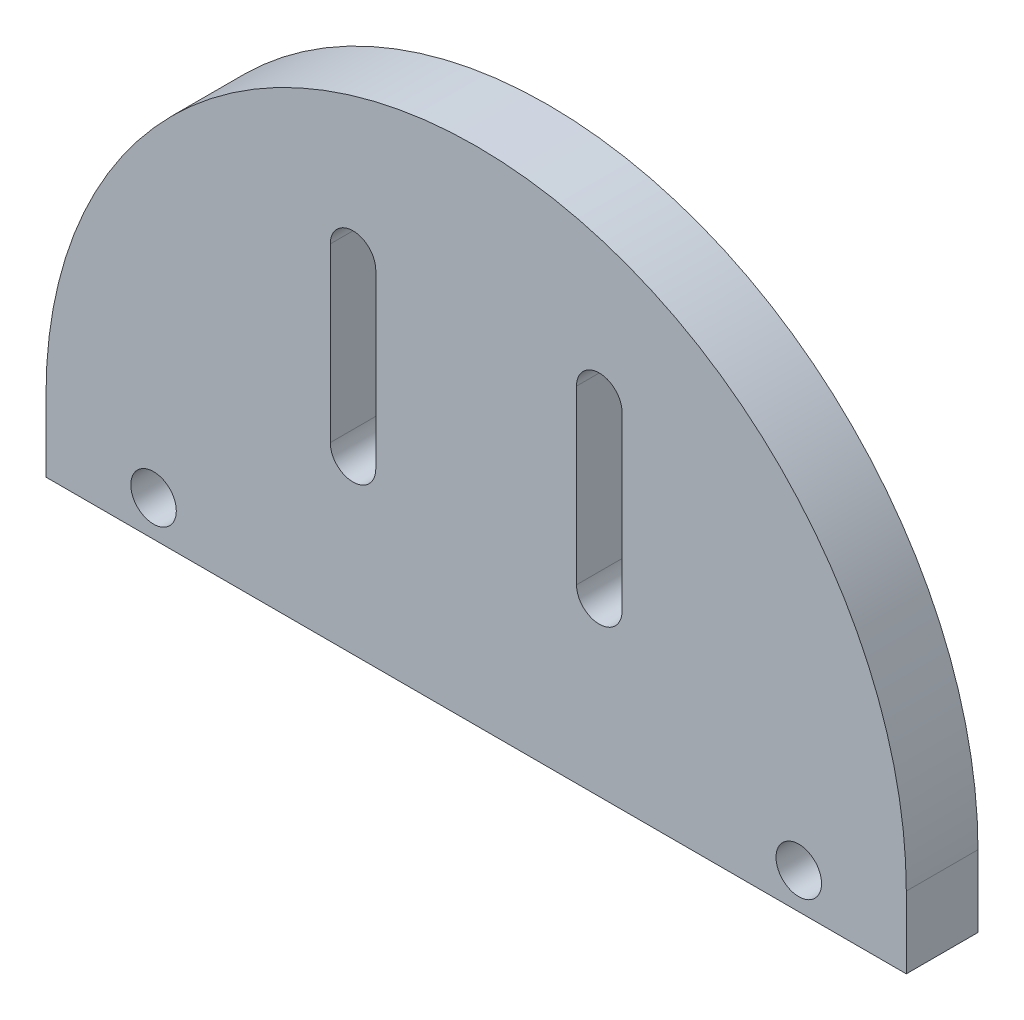
ISO-10303-21;
HEADER;
FILE_DESCRIPTION(('STEP AP214'),'2;1');
FILE_NAME('part.step','',(''),(''),'','','');
FILE_SCHEMA(('AUTOMOTIVE_DESIGN { 1 0 10303 214 1 1 1 1 }'));
ENDSEC;
DATA;
#1=APPLICATION_CONTEXT('core data for automotive mechanical design processes');
#2=APPLICATION_PROTOCOL_DEFINITION('international standard','automotive_design',2000,#1);
#3=PRODUCT_CONTEXT('',#1,'mechanical');
#4=PRODUCT('Part','Part','',(#3));
#5=PRODUCT_RELATED_PRODUCT_CATEGORY('part','',(#4));
#6=PRODUCT_DEFINITION_FORMATION('','',#4);
#7=PRODUCT_DEFINITION_CONTEXT('part definition',#1,'design');
#8=PRODUCT_DEFINITION('design','',#6,#7);
#9=PRODUCT_DEFINITION_SHAPE('','',#8);
#10=(LENGTH_UNIT() NAMED_UNIT(*) SI_UNIT(.MILLI.,.METRE.));
#11=(NAMED_UNIT(*) PLANE_ANGLE_UNIT() SI_UNIT($,.RADIAN.));
#12=(NAMED_UNIT(*) SI_UNIT($,.STERADIAN.) SOLID_ANGLE_UNIT());
#13=UNCERTAINTY_MEASURE_WITH_UNIT(LENGTH_MEASURE(1.E-05),#10,'distance_accuracy_value','');
#14=(GEOMETRIC_REPRESENTATION_CONTEXT(3) GLOBAL_UNCERTAINTY_ASSIGNED_CONTEXT((#13)) GLOBAL_UNIT_ASSIGNED_CONTEXT((#10,
#11,#12)) REPRESENTATION_CONTEXT('',''));
#15=CARTESIAN_POINT('',(0.,0.,0.));
#16=DIRECTION('',(0.,0.,1.));
#17=DIRECTION('',(1.,0.,0.));
#18=AXIS2_PLACEMENT_3D('',#15,#16,#17);
#19=CARTESIAN_POINT('',(0.,0.,5.));
#20=DIRECTION('',(0.,0.,1.));
#21=DIRECTION('',(1.,0.,0.));
#22=AXIS2_PLACEMENT_3D('',#19,#20,#21);
#23=PLANE('',#22);
#24=CARTESIAN_POINT('',(-22.5,-2.5,5.));
#25=DIRECTION('',(0.,0.,1.));
#26=DIRECTION('',(1.,0.,0.));
#27=AXIS2_PLACEMENT_3D('',#24,#25,#26);
#28=CIRCLE('',#27,1.5875);
#29=CARTESIAN_POINT('',(-20.9125,-2.5,5.));
#30=VERTEX_POINT('',#29);
#31=EDGE_CURVE('E151',#30,#30,#28,.T.);
#32=ORIENTED_EDGE('',*,*,#31,.F.);
#33=EDGE_LOOP('',(#32));
#34=FACE_BOUND('',#33,.T.);
#35=DIRECTION('',(0.,-1.,0.));
#36=VECTOR('',#35,1.);
#37=CARTESIAN_POINT('',(7.,7.,5.));
#38=LINE('',#37,#36);
#39=CARTESIAN_POINT('',(7.,19.,5.));
#40=VERTEX_POINT('',#39);
#41=CARTESIAN_POINT('',(7.,7.,5.));
#42=VERTEX_POINT('',#41);
#43=EDGE_CURVE('E163',#40,#42,#38,.T.);
#44=ORIENTED_EDGE('',*,*,#43,.F.);
#45=CARTESIAN_POINT('',(8.5875,19.,5.));
#46=DIRECTION('',(0.,0.,1.));
#47=DIRECTION('',(-1.,0.,0.));
#48=AXIS2_PLACEMENT_3D('',#45,#46,#47);
#49=CIRCLE('',#48,1.5875);
#50=CARTESIAN_POINT('',(10.175,19.,5.));
#51=VERTEX_POINT('',#50);
#52=EDGE_CURVE('E161',#51,#40,#49,.T.);
#53=ORIENTED_EDGE('',*,*,#52,.F.);
#54=DIRECTION('',(0.,1.,0.));
#55=VECTOR('',#54,1.);
#56=CARTESIAN_POINT('',(10.175,7.,5.));
#57=LINE('',#56,#55);
#58=CARTESIAN_POINT('',(10.175,7.,5.));
#59=VERTEX_POINT('',#58);
#60=EDGE_CURVE('E169',#59,#51,#57,.T.);
#61=ORIENTED_EDGE('',*,*,#60,.F.);
#62=CARTESIAN_POINT('',(8.5875,7.,5.));
#63=DIRECTION('',(0.,0.,1.));
#64=DIRECTION('',(-1.,0.,0.));
#65=AXIS2_PLACEMENT_3D('',#62,#63,#64);
#66=CIRCLE('',#65,1.5875);
#67=EDGE_CURVE('E166',#42,#59,#66,.T.);
#68=ORIENTED_EDGE('',*,*,#67,.F.);
#69=EDGE_LOOP('',(#44,#53,#61,#68));
#70=FACE_BOUND('',#69,.T.);
#71=CARTESIAN_POINT('',(0.,0.,5.));
#72=DIRECTION('',(0.,0.,1.));
#73=DIRECTION('',(1.,0.,0.));
#74=AXIS2_PLACEMENT_3D('',#71,#72,#73);
#75=CIRCLE('',#74,30.);
#76=CARTESIAN_POINT('',(30.,0.,5.));
#77=VERTEX_POINT('',#76);
#78=CARTESIAN_POINT('',(-30.,0.,5.));
#79=VERTEX_POINT('',#78);
#80=EDGE_CURVE('E192',#77,#79,#75,.T.);
#81=ORIENTED_EDGE('',*,*,#80,.T.);
#82=DIRECTION('',(0.,-1.,0.));
#83=VECTOR('',#82,1.);
#84=CARTESIAN_POINT('',(-30.,0.,5.));
#85=LINE('',#84,#83);
#86=CARTESIAN_POINT('',(-30.,-5.,5.));
#87=VERTEX_POINT('',#86);
#88=EDGE_CURVE('E195',#79,#87,#85,.T.);
#89=ORIENTED_EDGE('',*,*,#88,.T.);
#90=DIRECTION('',(1.,0.,0.));
#91=VECTOR('',#90,1.);
#92=CARTESIAN_POINT('',(-30.,-5.,5.));
#93=LINE('',#92,#91);
#94=CARTESIAN_POINT('',(30.,-5.,5.));
#95=VERTEX_POINT('',#94);
#96=EDGE_CURVE('E198',#87,#95,#93,.T.);
#97=ORIENTED_EDGE('',*,*,#96,.T.);
#98=DIRECTION('',(0.,1.,0.));
#99=VECTOR('',#98,1.);
#100=CARTESIAN_POINT('',(30.,-5.,5.));
#101=LINE('',#100,#99);
#102=EDGE_CURVE('E200',#95,#77,#101,.T.);
#103=ORIENTED_EDGE('',*,*,#102,.T.);
#104=EDGE_LOOP('',(#81,#89,#97,#103));
#105=FACE_BOUND('',#104,.T.);
#106=DIRECTION('',(0.,1.,0.));
#107=VECTOR('',#106,1.);
#108=CARTESIAN_POINT('',(-7.,7.,5.));
#109=LINE('',#108,#107);
#110=CARTESIAN_POINT('',(-7.,7.,5.));
#111=VERTEX_POINT('',#110);
#112=CARTESIAN_POINT('',(-7.,19.,5.));
#113=VERTEX_POINT('',#112);
#114=EDGE_CURVE('E130',#111,#113,#109,.T.);
#115=ORIENTED_EDGE('',*,*,#114,.F.);
#116=CARTESIAN_POINT('',(-8.5875,7.,5.));
#117=DIRECTION('',(0.,0.,1.));
#118=DIRECTION('',(1.,0.,0.));
#119=AXIS2_PLACEMENT_3D('',#116,#117,#118);
#120=CIRCLE('',#119,1.5875);
#121=CARTESIAN_POINT('',(-10.175,7.,5.));
#122=VERTEX_POINT('',#121);
#123=EDGE_CURVE('E122',#122,#111,#120,.T.);
#124=ORIENTED_EDGE('',*,*,#123,.F.);
#125=DIRECTION('',(0.,-1.,0.));
#126=VECTOR('',#125,1.);
#127=CARTESIAN_POINT('',(-10.175,7.,5.));
#128=LINE('',#127,#126);
#129=CARTESIAN_POINT('',(-10.175,19.,5.));
#130=VERTEX_POINT('',#129);
#131=EDGE_CURVE('E145',#130,#122,#128,.T.);
#132=ORIENTED_EDGE('',*,*,#131,.F.);
#133=CARTESIAN_POINT('',(-8.5875,19.,5.));
#134=DIRECTION('',(0.,0.,1.));
#135=DIRECTION('',(1.,0.,0.));
#136=AXIS2_PLACEMENT_3D('',#133,#134,#135);
#137=CIRCLE('',#136,1.5875);
#138=EDGE_CURVE('E143',#113,#130,#137,.T.);
#139=ORIENTED_EDGE('',*,*,#138,.F.);
#140=EDGE_LOOP('',(#115,#124,#132,#139));
#141=FACE_BOUND('',#140,.T.);
#142=CARTESIAN_POINT('',(22.5,-2.5,5.));
#143=DIRECTION('',(0.,0.,1.));
#144=DIRECTION('',(1.,0.,0.));
#145=AXIS2_PLACEMENT_3D('',#142,#143,#144);
#146=CIRCLE('',#145,1.5875);
#147=CARTESIAN_POINT('',(24.0875,-2.5,5.));
#148=VERTEX_POINT('',#147);
#149=EDGE_CURVE('E310',#148,#148,#146,.T.);
#150=ORIENTED_EDGE('',*,*,#149,.F.);
#151=EDGE_LOOP('',(#150));
#152=FACE_BOUND('',#151,.T.);
#153=ADVANCED_FACE('F33',(#34,#70,#105,#141,#152),#23,.T.);
#154=CARTESIAN_POINT('',(0.,0.,0.));
#155=DIRECTION('',(0.,0.,1.));
#156=DIRECTION('',(1.,0.,0.));
#157=AXIS2_PLACEMENT_3D('',#154,#155,#156);
#158=PLANE('',#157);
#159=CARTESIAN_POINT('',(-22.5,-2.5,0.));
#160=DIRECTION('',(0.,0.,1.));
#161=DIRECTION('',(1.,0.,0.));
#162=AXIS2_PLACEMENT_3D('',#159,#160,#161);
#163=CIRCLE('',#162,1.5875);
#164=CARTESIAN_POINT('',(-20.9125,-2.5,0.));
#165=VERTEX_POINT('',#164);
#166=EDGE_CURVE('E316',#165,#165,#163,.T.);
#167=ORIENTED_EDGE('',*,*,#166,.T.);
#168=EDGE_LOOP('',(#167));
#169=FACE_BOUND('',#168,.T.);
#170=CARTESIAN_POINT('',(8.5875,19.,0.));
#171=DIRECTION('',(0.,0.,1.));
#172=DIRECTION('',(-1.,0.,0.));
#173=AXIS2_PLACEMENT_3D('',#170,#171,#172);
#174=CIRCLE('',#173,1.5875);
#175=CARTESIAN_POINT('',(10.175,19.,0.));
#176=VERTEX_POINT('',#175);
#177=CARTESIAN_POINT('',(7.,19.,0.));
#178=VERTEX_POINT('',#177);
#179=EDGE_CURVE('E138',#176,#178,#174,.T.);
#180=ORIENTED_EDGE('',*,*,#179,.T.);
#181=DIRECTION('',(0.,-1.,0.));
#182=VECTOR('',#181,1.);
#183=CARTESIAN_POINT('',(7.,7.,0.));
#184=LINE('',#183,#182);
#185=CARTESIAN_POINT('',(7.,7.,0.));
#186=VERTEX_POINT('',#185);
#187=EDGE_CURVE('E174',#178,#186,#184,.T.);
#188=ORIENTED_EDGE('',*,*,#187,.T.);
#189=CARTESIAN_POINT('',(8.5875,7.,0.));
#190=DIRECTION('',(0.,0.,1.));
#191=DIRECTION('',(-1.,0.,0.));
#192=AXIS2_PLACEMENT_3D('',#189,#190,#191);
#193=CIRCLE('',#192,1.5875);
#194=CARTESIAN_POINT('',(10.175,7.,0.));
#195=VERTEX_POINT('',#194);
#196=EDGE_CURVE('E177',#186,#195,#193,.T.);
#197=ORIENTED_EDGE('',*,*,#196,.T.);
#198=DIRECTION('',(0.,1.,0.));
#199=VECTOR('',#198,1.);
#200=CARTESIAN_POINT('',(10.175,7.,0.));
#201=LINE('',#200,#199);
#202=EDGE_CURVE('E164',#195,#176,#201,.T.);
#203=ORIENTED_EDGE('',*,*,#202,.T.);
#204=EDGE_LOOP('',(#180,#188,#197,#203));
#205=FACE_BOUND('',#204,.T.);
#206=CARTESIAN_POINT('',(0.,0.,0.));
#207=DIRECTION('',(0.,0.,1.));
#208=DIRECTION('',(1.,0.,0.));
#209=AXIS2_PLACEMENT_3D('',#206,#207,#208);
#210=CIRCLE('',#209,30.);
#211=CARTESIAN_POINT('',(30.,0.,0.));
#212=VERTEX_POINT('',#211);
#213=CARTESIAN_POINT('',(-30.,0.,0.));
#214=VERTEX_POINT('',#213);
#215=EDGE_CURVE('E191',#212,#214,#210,.T.);
#216=ORIENTED_EDGE('',*,*,#215,.F.);
#217=DIRECTION('',(0.,1.,0.));
#218=VECTOR('',#217,1.);
#219=CARTESIAN_POINT('',(30.,-5.,0.));
#220=LINE('',#219,#218);
#221=CARTESIAN_POINT('',(30.,-5.,0.));
#222=VERTEX_POINT('',#221);
#223=EDGE_CURVE('E196',#222,#212,#220,.T.);
#224=ORIENTED_EDGE('',*,*,#223,.F.);
#225=DIRECTION('',(1.,0.,0.));
#226=VECTOR('',#225,1.);
#227=CARTESIAN_POINT('',(-30.,-5.,0.));
#228=LINE('',#227,#226);
#229=CARTESIAN_POINT('',(-30.,-5.,0.));
#230=VERTEX_POINT('',#229);
#231=EDGE_CURVE('E207',#230,#222,#228,.T.);
#232=ORIENTED_EDGE('',*,*,#231,.F.);
#233=DIRECTION('',(0.,-1.,0.));
#234=VECTOR('',#233,1.);
#235=CARTESIAN_POINT('',(-30.,0.,0.));
#236=LINE('',#235,#234);
#237=EDGE_CURVE('E205',#214,#230,#236,.T.);
#238=ORIENTED_EDGE('',*,*,#237,.F.);
#239=EDGE_LOOP('',(#216,#224,#232,#238));
#240=FACE_BOUND('',#239,.T.);
#241=CARTESIAN_POINT('',(-8.5875,7.,0.));
#242=DIRECTION('',(0.,0.,1.));
#243=DIRECTION('',(1.,0.,0.));
#244=AXIS2_PLACEMENT_3D('',#241,#242,#243);
#245=CIRCLE('',#244,1.5875);
#246=CARTESIAN_POINT('',(-10.175,7.,0.));
#247=VERTEX_POINT('',#246);
#248=CARTESIAN_POINT('',(-7.,7.,0.));
#249=VERTEX_POINT('',#248);
#250=EDGE_CURVE('E56',#247,#249,#245,.T.);
#251=ORIENTED_EDGE('',*,*,#250,.T.);
#252=DIRECTION('',(0.,1.,0.));
#253=VECTOR('',#252,1.);
#254=CARTESIAN_POINT('',(-7.,7.,0.));
#255=LINE('',#254,#253);
#256=CARTESIAN_POINT('',(-7.,19.,0.));
#257=VERTEX_POINT('',#256);
#258=EDGE_CURVE('E137',#249,#257,#255,.T.);
#259=ORIENTED_EDGE('',*,*,#258,.T.);
#260=CARTESIAN_POINT('',(-8.5875,19.,0.));
#261=DIRECTION('',(0.,0.,1.));
#262=DIRECTION('',(1.,0.,0.));
#263=AXIS2_PLACEMENT_3D('',#260,#261,#262);
#264=CIRCLE('',#263,1.5875);
#265=CARTESIAN_POINT('',(-10.175,19.,0.));
#266=VERTEX_POINT('',#265);
#267=EDGE_CURVE('E153',#257,#266,#264,.T.);
#268=ORIENTED_EDGE('',*,*,#267,.T.);
#269=DIRECTION('',(0.,-1.,0.));
#270=VECTOR('',#269,1.);
#271=CARTESIAN_POINT('',(-10.175,7.,0.));
#272=LINE('',#271,#270);
#273=EDGE_CURVE('E131',#266,#247,#272,.T.);
#274=ORIENTED_EDGE('',*,*,#273,.T.);
#275=EDGE_LOOP('',(#251,#259,#268,#274));
#276=FACE_BOUND('',#275,.T.);
#277=CARTESIAN_POINT('',(22.5,-2.5,0.));
#278=DIRECTION('',(0.,0.,1.));
#279=DIRECTION('',(1.,0.,0.));
#280=AXIS2_PLACEMENT_3D('',#277,#278,#279);
#281=CIRCLE('',#280,1.5875);
#282=CARTESIAN_POINT('',(24.0875,-2.5,0.));
#283=VERTEX_POINT('',#282);
#284=EDGE_CURVE('E313',#283,#283,#281,.T.);
#285=ORIENTED_EDGE('',*,*,#284,.T.);
#286=EDGE_LOOP('',(#285));
#287=FACE_BOUND('',#286,.T.);
#288=ADVANCED_FACE('F225',(#169,#205,#240,#276,#287),#158,.F.);
#289=CARTESIAN_POINT('',(0.,0.,5.));
#290=DIRECTION('',(0.,0.,-1.));
#291=DIRECTION('',(-1.,0.,0.));
#292=AXIS2_PLACEMENT_3D('',#289,#290,#291);
#293=CYLINDRICAL_SURFACE('',#292,30.);
#294=ORIENTED_EDGE('',*,*,#215,.T.);
#295=DIRECTION('',(0.,0.,-1.));
#296=VECTOR('',#295,1.);
#297=CARTESIAN_POINT('',(-30.,0.,5.));
#298=LINE('',#297,#296);
#299=EDGE_CURVE('E11',#79,#214,#298,.T.);
#300=ORIENTED_EDGE('',*,*,#299,.F.);
#301=ORIENTED_EDGE('',*,*,#80,.F.);
#302=DIRECTION('',(0.,0.,-1.));
#303=VECTOR('',#302,1.);
#304=CARTESIAN_POINT('',(30.,0.,5.));
#305=LINE('',#304,#303);
#306=EDGE_CURVE('E202',#77,#212,#305,.T.);
#307=ORIENTED_EDGE('',*,*,#306,.T.);
#308=EDGE_LOOP('',(#294,#300,#301,#307));
#309=FACE_BOUND('',#308,.T.);
#310=ADVANCED_FACE('F35',(#309),#293,.T.);
#311=CARTESIAN_POINT('',(-30.,0.,5.));
#312=DIRECTION('',(1.,0.,0.));
#313=DIRECTION('',(0.,0.,-1.));
#314=AXIS2_PLACEMENT_3D('',#311,#312,#313);
#315=PLANE('',#314);
#316=ORIENTED_EDGE('',*,*,#237,.T.);
#317=DIRECTION('',(0.,0.,-1.));
#318=VECTOR('',#317,1.);
#319=CARTESIAN_POINT('',(-30.,-5.,5.));
#320=LINE('',#319,#318);
#321=EDGE_CURVE('E41',#87,#230,#320,.T.);
#322=ORIENTED_EDGE('',*,*,#321,.F.);
#323=ORIENTED_EDGE('',*,*,#88,.F.);
#324=ORIENTED_EDGE('',*,*,#299,.T.);
#325=EDGE_LOOP('',(#316,#322,#323,#324));
#326=FACE_BOUND('',#325,.T.);
#327=ADVANCED_FACE('F235',(#326),#315,.F.);
#328=CARTESIAN_POINT('',(-30.,-5.,5.));
#329=DIRECTION('',(0.,1.,0.));
#330=DIRECTION('',(0.,0.,1.));
#331=AXIS2_PLACEMENT_3D('',#328,#329,#330);
#332=PLANE('',#331);
#333=ORIENTED_EDGE('',*,*,#231,.T.);
#334=DIRECTION('',(0.,0.,-1.));
#335=VECTOR('',#334,1.);
#336=CARTESIAN_POINT('',(30.,-5.,5.));
#337=LINE('',#336,#335);
#338=EDGE_CURVE('E212',#95,#222,#337,.T.);
#339=ORIENTED_EDGE('',*,*,#338,.F.);
#340=ORIENTED_EDGE('',*,*,#96,.F.);
#341=ORIENTED_EDGE('',*,*,#321,.T.);
#342=EDGE_LOOP('',(#333,#339,#340,#341));
#343=FACE_BOUND('',#342,.T.);
#344=ADVANCED_FACE('F219',(#343),#332,.F.);
#345=CARTESIAN_POINT('',(30.,-5.,5.));
#346=DIRECTION('',(-1.,0.,0.));
#347=DIRECTION('',(0.,0.,1.));
#348=AXIS2_PLACEMENT_3D('',#345,#346,#347);
#349=PLANE('',#348);
#350=ORIENTED_EDGE('',*,*,#223,.T.);
#351=ORIENTED_EDGE('',*,*,#306,.F.);
#352=ORIENTED_EDGE('',*,*,#102,.F.);
#353=ORIENTED_EDGE('',*,*,#338,.T.);
#354=EDGE_LOOP('',(#350,#351,#352,#353));
#355=FACE_BOUND('',#354,.T.);
#356=ADVANCED_FACE('F229',(#355),#349,.F.);
#357=CARTESIAN_POINT('',(8.5875,19.,5.));
#358=DIRECTION('',(0.,0.,-1.));
#359=DIRECTION('',(-1.,0.,0.));
#360=AXIS2_PLACEMENT_3D('',#357,#358,#359);
#361=CYLINDRICAL_SURFACE('',#360,1.5875);
#362=ORIENTED_EDGE('',*,*,#179,.F.);
#363=DIRECTION('',(0.,0.,-1.));
#364=VECTOR('',#363,1.);
#365=CARTESIAN_POINT('',(10.175,19.,5.));
#366=LINE('',#365,#364);
#367=EDGE_CURVE('E171',#51,#176,#366,.T.);
#368=ORIENTED_EDGE('',*,*,#367,.F.);
#369=ORIENTED_EDGE('',*,*,#52,.T.);
#370=DIRECTION('',(0.,0.,-1.));
#371=VECTOR('',#370,1.);
#372=CARTESIAN_POINT('',(7.,19.,5.));
#373=LINE('',#372,#371);
#374=EDGE_CURVE('E188',#40,#178,#373,.T.);
#375=ORIENTED_EDGE('',*,*,#374,.T.);
#376=EDGE_LOOP('',(#362,#368,#369,#375));
#377=FACE_BOUND('',#376,.T.);
#378=ADVANCED_FACE('F253',(#377),#361,.F.);
#379=CARTESIAN_POINT('',(7.,7.,5.));
#380=DIRECTION('',(1.,0.,0.));
#381=DIRECTION('',(0.,0.,-1.));
#382=AXIS2_PLACEMENT_3D('',#379,#380,#381);
#383=PLANE('',#382);
#384=ORIENTED_EDGE('',*,*,#187,.F.);
#385=ORIENTED_EDGE('',*,*,#374,.F.);
#386=ORIENTED_EDGE('',*,*,#43,.T.);
#387=DIRECTION('',(0.,0.,-1.));
#388=VECTOR('',#387,1.);
#389=CARTESIAN_POINT('',(7.,7.,5.));
#390=LINE('',#389,#388);
#391=EDGE_CURVE('E186',#42,#186,#390,.T.);
#392=ORIENTED_EDGE('',*,*,#391,.T.);
#393=EDGE_LOOP('',(#384,#385,#386,#392));
#394=FACE_BOUND('',#393,.T.);
#395=ADVANCED_FACE('F260',(#394),#383,.T.);
#396=CARTESIAN_POINT('',(8.5875,7.,5.));
#397=DIRECTION('',(0.,0.,-1.));
#398=DIRECTION('',(-1.,0.,0.));
#399=AXIS2_PLACEMENT_3D('',#396,#397,#398);
#400=CYLINDRICAL_SURFACE('',#399,1.5875);
#401=ORIENTED_EDGE('',*,*,#196,.F.);
#402=ORIENTED_EDGE('',*,*,#391,.F.);
#403=ORIENTED_EDGE('',*,*,#67,.T.);
#404=DIRECTION('',(0.,0.,-1.));
#405=VECTOR('',#404,1.);
#406=CARTESIAN_POINT('',(10.175,7.,5.));
#407=LINE('',#406,#405);
#408=EDGE_CURVE('E184',#59,#195,#407,.T.);
#409=ORIENTED_EDGE('',*,*,#408,.T.);
#410=EDGE_LOOP('',(#401,#402,#403,#409));
#411=FACE_BOUND('',#410,.T.);
#412=ADVANCED_FACE('F265',(#411),#400,.F.);
#413=CARTESIAN_POINT('',(10.175,7.,5.));
#414=DIRECTION('',(-1.,0.,0.));
#415=DIRECTION('',(0.,0.,1.));
#416=AXIS2_PLACEMENT_3D('',#413,#414,#415);
#417=PLANE('',#416);
#418=ORIENTED_EDGE('',*,*,#202,.F.);
#419=ORIENTED_EDGE('',*,*,#408,.F.);
#420=ORIENTED_EDGE('',*,*,#60,.T.);
#421=ORIENTED_EDGE('',*,*,#367,.T.);
#422=EDGE_LOOP('',(#418,#419,#420,#421));
#423=FACE_BOUND('',#422,.T.);
#424=ADVANCED_FACE('F273',(#423),#417,.T.);
#425=CARTESIAN_POINT('',(-8.5875,7.,5.));
#426=DIRECTION('',(0.,0.,-1.));
#427=DIRECTION('',(-1.,0.,0.));
#428=AXIS2_PLACEMENT_3D('',#425,#426,#427);
#429=CYLINDRICAL_SURFACE('',#428,1.5875);
#430=ORIENTED_EDGE('',*,*,#250,.F.);
#431=DIRECTION('',(0.,0.,-1.));
#432=VECTOR('',#431,1.);
#433=CARTESIAN_POINT('',(-10.175,7.,5.));
#434=LINE('',#433,#432);
#435=EDGE_CURVE('E126',#122,#247,#434,.T.);
#436=ORIENTED_EDGE('',*,*,#435,.F.);
#437=ORIENTED_EDGE('',*,*,#123,.T.);
#438=DIRECTION('',(0.,0.,-1.));
#439=VECTOR('',#438,1.);
#440=CARTESIAN_POINT('',(-7.,7.,5.));
#441=LINE('',#440,#439);
#442=EDGE_CURVE('E125',#111,#249,#441,.T.);
#443=ORIENTED_EDGE('',*,*,#442,.T.);
#444=EDGE_LOOP('',(#430,#436,#437,#443));
#445=FACE_BOUND('',#444,.T.);
#446=ADVANCED_FACE('F124',(#445),#429,.F.);
#447=CARTESIAN_POINT('',(-7.,7.,5.));
#448=DIRECTION('',(-1.,0.,0.));
#449=DIRECTION('',(0.,0.,1.));
#450=AXIS2_PLACEMENT_3D('',#447,#448,#449);
#451=PLANE('',#450);
#452=ORIENTED_EDGE('',*,*,#258,.F.);
#453=ORIENTED_EDGE('',*,*,#442,.F.);
#454=ORIENTED_EDGE('',*,*,#114,.T.);
#455=DIRECTION('',(0.,0.,-1.));
#456=VECTOR('',#455,1.);
#457=CARTESIAN_POINT('',(-7.,19.,5.));
#458=LINE('',#457,#456);
#459=EDGE_CURVE('E139',#113,#257,#458,.T.);
#460=ORIENTED_EDGE('',*,*,#459,.T.);
#461=EDGE_LOOP('',(#452,#453,#454,#460));
#462=FACE_BOUND('',#461,.T.);
#463=ADVANCED_FACE('F134',(#462),#451,.T.);
#464=CARTESIAN_POINT('',(-8.5875,19.,5.));
#465=DIRECTION('',(0.,0.,-1.));
#466=DIRECTION('',(-1.,0.,0.));
#467=AXIS2_PLACEMENT_3D('',#464,#465,#466);
#468=CYLINDRICAL_SURFACE('',#467,1.5875);
#469=ORIENTED_EDGE('',*,*,#267,.F.);
#470=ORIENTED_EDGE('',*,*,#459,.F.);
#471=ORIENTED_EDGE('',*,*,#138,.T.);
#472=DIRECTION('',(0.,0.,-1.));
#473=VECTOR('',#472,1.);
#474=CARTESIAN_POINT('',(-10.175,19.,5.));
#475=LINE('',#474,#473);
#476=EDGE_CURVE('E48',#130,#266,#475,.T.);
#477=ORIENTED_EDGE('',*,*,#476,.T.);
#478=EDGE_LOOP('',(#469,#470,#471,#477));
#479=FACE_BOUND('',#478,.T.);
#480=ADVANCED_FACE('F291',(#479),#468,.F.);
#481=CARTESIAN_POINT('',(-10.175,7.,5.));
#482=DIRECTION('',(1.,0.,0.));
#483=DIRECTION('',(0.,0.,-1.));
#484=AXIS2_PLACEMENT_3D('',#481,#482,#483);
#485=PLANE('',#484);
#486=ORIENTED_EDGE('',*,*,#273,.F.);
#487=ORIENTED_EDGE('',*,*,#476,.F.);
#488=ORIENTED_EDGE('',*,*,#131,.T.);
#489=ORIENTED_EDGE('',*,*,#435,.T.);
#490=EDGE_LOOP('',(#486,#487,#488,#489));
#491=FACE_BOUND('',#490,.T.);
#492=ADVANCED_FACE('F294',(#491),#485,.T.);
#493=CARTESIAN_POINT('',(-22.5,-2.5,5.));
#494=DIRECTION('',(0.,0.,-1.));
#495=DIRECTION('',(-1.,0.,0.));
#496=AXIS2_PLACEMENT_3D('',#493,#494,#495);
#497=CYLINDRICAL_SURFACE('',#496,1.5875);
#498=ORIENTED_EDGE('',*,*,#31,.T.);
#499=EDGE_LOOP('',(#498));
#500=FACE_BOUND('',#499,.T.);
#501=ORIENTED_EDGE('',*,*,#166,.F.);
#502=EDGE_LOOP('',(#501));
#503=FACE_BOUND('',#502,.T.);
#504=ADVANCED_FACE('F298',(#500,#503),#497,.F.);
#505=CARTESIAN_POINT('',(22.5,-2.5,5.));
#506=DIRECTION('',(0.,0.,-1.));
#507=DIRECTION('',(-1.,0.,0.));
#508=AXIS2_PLACEMENT_3D('',#505,#506,#507);
#509=CYLINDRICAL_SURFACE('',#508,1.5875);
#510=ORIENTED_EDGE('',*,*,#149,.T.);
#511=EDGE_LOOP('',(#510));
#512=FACE_BOUND('',#511,.T.);
#513=ORIENTED_EDGE('',*,*,#284,.F.);
#514=EDGE_LOOP('',(#513));
#515=FACE_BOUND('',#514,.T.);
#516=ADVANCED_FACE('F301',(#512,#515),#509,.F.);
#517=CLOSED_SHELL('',(#153,#288,#310,#327,#344,#356,#378,#395,#412,#424,#446,#463,#480,#492,
#504,#516));
#518=MANIFOLD_SOLID_BREP('B2',#517);
#519=ADVANCED_BREP_SHAPE_REPRESENTATION('',(#18,#518),#14);
#520=SHAPE_DEFINITION_REPRESENTATION(#9,#519);
ENDSEC;
END-ISO-10303-21;
